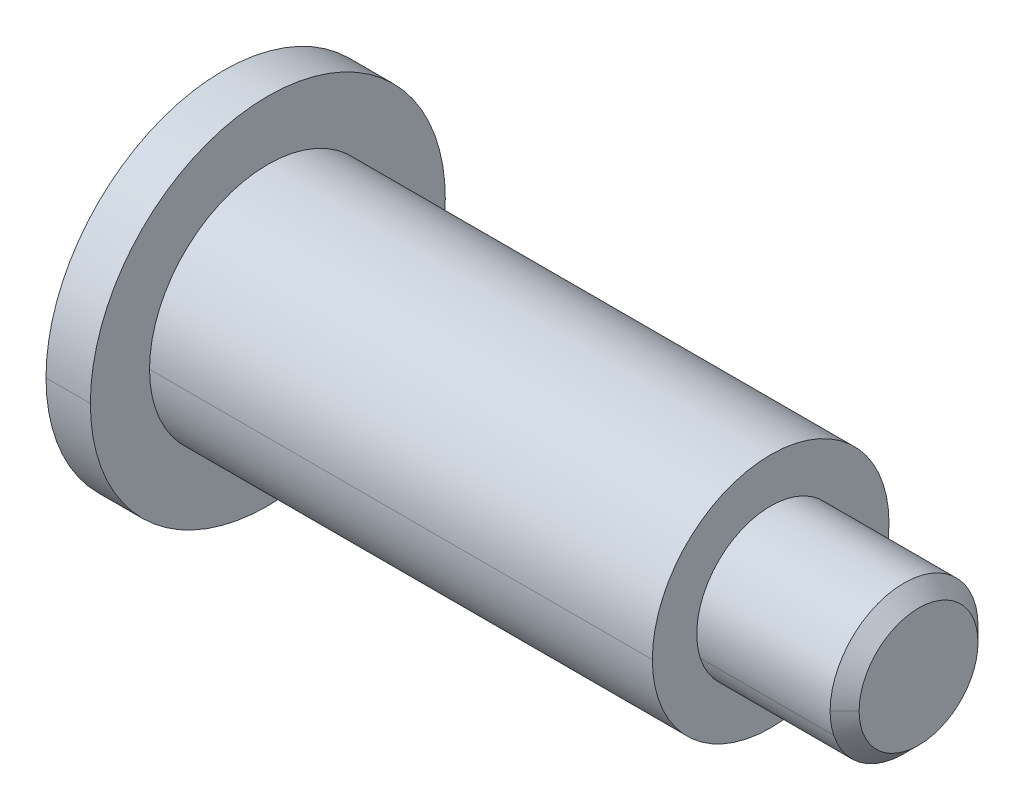
ISO-10303-21;
HEADER;
FILE_DESCRIPTION(('STEP AP214'),'2;1');
FILE_NAME('part.step','',(''),(''),'','','');
FILE_SCHEMA(('AUTOMOTIVE_DESIGN { 1 0 10303 214 1 1 1 1 }'));
ENDSEC;
DATA;
#1=APPLICATION_CONTEXT('core data for automotive mechanical design processes');
#2=APPLICATION_PROTOCOL_DEFINITION('international standard','automotive_design',2000,#1);
#3=PRODUCT_CONTEXT('',#1,'mechanical');
#4=PRODUCT('Part','Part','',(#3));
#5=PRODUCT_RELATED_PRODUCT_CATEGORY('part','',(#4));
#6=PRODUCT_DEFINITION_FORMATION('','',#4);
#7=PRODUCT_DEFINITION_CONTEXT('part definition',#1,'design');
#8=PRODUCT_DEFINITION('design','',#6,#7);
#9=PRODUCT_DEFINITION_SHAPE('','',#8);
#10=(LENGTH_UNIT() NAMED_UNIT(*) SI_UNIT(.MILLI.,.METRE.));
#11=(NAMED_UNIT(*) PLANE_ANGLE_UNIT() SI_UNIT($,.RADIAN.));
#12=(NAMED_UNIT(*) SI_UNIT($,.STERADIAN.) SOLID_ANGLE_UNIT());
#13=UNCERTAINTY_MEASURE_WITH_UNIT(LENGTH_MEASURE(1.E-05),#10,'distance_accuracy_value','');
#14=(GEOMETRIC_REPRESENTATION_CONTEXT(3) GLOBAL_UNCERTAINTY_ASSIGNED_CONTEXT((#13)) GLOBAL_UNIT_ASSIGNED_CONTEXT((#10,
#11,#12)) REPRESENTATION_CONTEXT('',''));
#15=CARTESIAN_POINT('',(0.,0.,0.));
#16=DIRECTION('',(0.,0.,1.));
#17=DIRECTION('',(1.,0.,0.));
#18=AXIS2_PLACEMENT_3D('',#15,#16,#17);
#19=CARTESIAN_POINT('',(-1.5,0.,0.));
#20=DIRECTION('',(1.,0.,0.));
#21=DIRECTION('',(0.,0.,-1.));
#22=AXIS2_PLACEMENT_3D('',#19,#20,#21);
#23=PLANE('',#22);
#24=CARTESIAN_POINT('',(-1.5,0.,0.));
#25=DIRECTION('',(1.,0.,0.));
#26=DIRECTION('',(0.,0.,-1.));
#27=AXIS2_PLACEMENT_3D('',#24,#25,#26);
#28=CIRCLE('',#27,6.);
#29=CARTESIAN_POINT('',(-1.5,0.,6.));
#30=VERTEX_POINT('',#29);
#31=CARTESIAN_POINT('',(-1.5,0.,-6.));
#32=VERTEX_POINT('',#31);
#33=EDGE_CURVE('E10',#30,#32,#28,.T.);
#34=ORIENTED_EDGE('',*,*,#33,.F.);
#35=CARTESIAN_POINT('',(-1.5,0.,0.));
#36=DIRECTION('',(1.,0.,0.));
#37=DIRECTION('',(0.,0.,-1.));
#38=AXIS2_PLACEMENT_3D('',#35,#36,#37);
#39=CIRCLE('',#38,6.);
#40=EDGE_CURVE('E23',#32,#30,#39,.T.);
#41=ORIENTED_EDGE('',*,*,#40,.F.);
#42=EDGE_LOOP('',(#34,#41));
#43=FACE_BOUND('',#42,.T.);
#44=DIRECTION('',(0.,0.500000000000009,-0.866025403784433));
#45=VECTOR('',#44,1.);
#46=CARTESIAN_POINT('',(-1.5,-1.7320508075689,0.));
#47=LINE('',#46,#45);
#48=CARTESIAN_POINT('',(-1.5,-1.7320508075689,0.));
#49=VERTEX_POINT('',#48);
#50=CARTESIAN_POINT('',(-1.5,-0.86602540378444,-1.5));
#51=VERTEX_POINT('',#50);
#52=EDGE_CURVE('E375',#49,#51,#47,.T.);
#53=ORIENTED_EDGE('',*,*,#52,.T.);
#54=DIRECTION('',(0.,1.,0.));
#55=VECTOR('',#54,1.);
#56=CARTESIAN_POINT('',(-1.5,-0.86602540378444,-1.5));
#57=LINE('',#56,#55);
#58=CARTESIAN_POINT('',(-1.5,0.86602540378444,-1.5));
#59=VERTEX_POINT('',#58);
#60=EDGE_CURVE('E371',#51,#59,#57,.T.);
#61=ORIENTED_EDGE('',*,*,#60,.T.);
#62=DIRECTION('',(0.,0.500000000000009,0.866025403784433));
#63=VECTOR('',#62,1.);
#64=CARTESIAN_POINT('',(-1.5,0.86602540378444,-1.5));
#65=LINE('',#64,#63);
#66=CARTESIAN_POINT('',(-1.5,1.7320508075689,0.));
#67=VERTEX_POINT('',#66);
#68=EDGE_CURVE('E367',#59,#67,#65,.T.);
#69=ORIENTED_EDGE('',*,*,#68,.T.);
#70=DIRECTION('',(0.,-0.500000000000009,0.866025403784433));
#71=VECTOR('',#70,1.);
#72=CARTESIAN_POINT('',(-1.5,1.7320508075689,0.));
#73=LINE('',#72,#71);
#74=CARTESIAN_POINT('',(-1.5,0.86602540378444,1.5));
#75=VERTEX_POINT('',#74);
#76=EDGE_CURVE('E363',#67,#75,#73,.T.);
#77=ORIENTED_EDGE('',*,*,#76,.T.);
#78=DIRECTION('',(0.,-1.,0.));
#79=VECTOR('',#78,1.);
#80=CARTESIAN_POINT('',(-1.5,0.86602540378444,1.5));
#81=LINE('',#80,#79);
#82=CARTESIAN_POINT('',(-1.5,-0.86602540378444,1.5));
#83=VERTEX_POINT('',#82);
#84=EDGE_CURVE('E359',#75,#83,#81,.T.);
#85=ORIENTED_EDGE('',*,*,#84,.T.);
#86=DIRECTION('',(0.,-0.500000000000009,-0.866025403784433));
#87=VECTOR('',#86,1.);
#88=CARTESIAN_POINT('',(-1.5,-0.86602540378444,1.5));
#89=LINE('',#88,#87);
#90=EDGE_CURVE('E355',#83,#49,#89,.T.);
#91=ORIENTED_EDGE('',*,*,#90,.T.);
#92=EDGE_LOOP('',(#53,#61,#69,#77,#85,#91));
#93=FACE_BOUND('',#92,.T.);
#94=ADVANCED_FACE('F15',(#43,#93),#23,.F.);
#95=CARTESIAN_POINT('',(1.5,-0.86602540378444,1.5));
#96=DIRECTION('',(0.,0.866025403784433,-0.500000000000009));
#97=DIRECTION('',(0.,0.500000000000009,0.866025403784433));
#98=AXIS2_PLACEMENT_3D('',#95,#96,#97);
#99=PLANE('',#98);
#100=ORIENTED_EDGE('',*,*,#90,.F.);
#101=DIRECTION('',(-1.,0.,0.));
#102=VECTOR('',#101,1.);
#103=CARTESIAN_POINT('',(1.5,-0.86602540378444,1.5));
#104=LINE('',#103,#102);
#105=CARTESIAN_POINT('',(1.5,-0.86602540378444,1.5));
#106=VERTEX_POINT('',#105);
#107=EDGE_CURVE('E350',#106,#83,#104,.T.);
#108=ORIENTED_EDGE('',*,*,#107,.F.);
#109=DIRECTION('',(0.,-0.500000000000009,-0.866025403784433));
#110=VECTOR('',#109,1.);
#111=CARTESIAN_POINT('',(1.5,-0.86602540378444,1.5));
#112=LINE('',#111,#110);
#113=CARTESIAN_POINT('',(1.5,-1.29903810567666,0.750000000000019));
#114=VERTEX_POINT('',#113);
#115=EDGE_CURVE('E346',#106,#114,#112,.T.);
#116=ORIENTED_EDGE('',*,*,#115,.T.);
#117=DIRECTION('',(0.,-0.500000000000009,-0.866025403784433));
#118=VECTOR('',#117,1.);
#119=CARTESIAN_POINT('',(1.5,-0.86602540378444,1.5));
#120=LINE('',#119,#118);
#121=CARTESIAN_POINT('',(1.5,-1.7320508075689,0.));
#122=VERTEX_POINT('',#121);
#123=EDGE_CURVE('E342',#114,#122,#120,.T.);
#124=ORIENTED_EDGE('',*,*,#123,.T.);
#125=DIRECTION('',(-1.,0.,0.));
#126=VECTOR('',#125,1.);
#127=CARTESIAN_POINT('',(1.5,-1.7320508075689,0.));
#128=LINE('',#127,#126);
#129=EDGE_CURVE('E337',#122,#49,#128,.T.);
#130=ORIENTED_EDGE('',*,*,#129,.T.);
#131=EDGE_LOOP('',(#100,#108,#116,#124,#130));
#132=FACE_BOUND('',#131,.T.);
#133=ADVANCED_FACE('F404',(#132),#99,.T.);
#134=CARTESIAN_POINT('',(1.5,-1.7320508075689,0.));
#135=DIRECTION('',(0.,0.866025403784433,0.500000000000009));
#136=DIRECTION('',(0.,-0.500000000000009,0.866025403784433));
#137=AXIS2_PLACEMENT_3D('',#134,#135,#136);
#138=PLANE('',#137);
#139=ORIENTED_EDGE('',*,*,#52,.F.);
#140=ORIENTED_EDGE('',*,*,#129,.F.);
#141=DIRECTION('',(0.,0.500000000000009,-0.866025403784433));
#142=VECTOR('',#141,1.);
#143=CARTESIAN_POINT('',(1.5,-1.7320508075689,0.));
#144=LINE('',#143,#142);
#145=CARTESIAN_POINT('',(1.5,-1.29903810567665,-0.750000000000014));
#146=VERTEX_POINT('',#145);
#147=EDGE_CURVE('E333',#122,#146,#144,.T.);
#148=ORIENTED_EDGE('',*,*,#147,.T.);
#149=DIRECTION('',(0.,0.500000000000009,-0.866025403784433));
#150=VECTOR('',#149,1.);
#151=CARTESIAN_POINT('',(1.5,-1.7320508075689,0.));
#152=LINE('',#151,#150);
#153=CARTESIAN_POINT('',(1.5,-0.86602540378444,-1.5));
#154=VERTEX_POINT('',#153);
#155=EDGE_CURVE('E329',#146,#154,#152,.T.);
#156=ORIENTED_EDGE('',*,*,#155,.T.);
#157=DIRECTION('',(-1.,0.,0.));
#158=VECTOR('',#157,1.);
#159=CARTESIAN_POINT('',(1.5,-0.86602540378444,-1.5));
#160=LINE('',#159,#158);
#161=EDGE_CURVE('E324',#154,#51,#160,.T.);
#162=ORIENTED_EDGE('',*,*,#161,.T.);
#163=EDGE_LOOP('',(#139,#140,#148,#156,#162));
#164=FACE_BOUND('',#163,.T.);
#165=ADVANCED_FACE('F408',(#164),#138,.T.);
#166=CARTESIAN_POINT('',(1.5,-0.86602540378444,-1.5));
#167=DIRECTION('',(0.,0.,1.));
#168=DIRECTION('',(1.,0.,0.));
#169=AXIS2_PLACEMENT_3D('',#166,#167,#168);
#170=PLANE('',#169);
#171=ORIENTED_EDGE('',*,*,#60,.F.);
#172=ORIENTED_EDGE('',*,*,#161,.F.);
#173=DIRECTION('',(0.,1.,0.));
#174=VECTOR('',#173,1.);
#175=CARTESIAN_POINT('',(1.5,-0.86602540378444,-1.5));
#176=LINE('',#175,#174);
#177=CARTESIAN_POINT('',(1.5,0.,-1.5));
#178=VERTEX_POINT('',#177);
#179=EDGE_CURVE('E320',#154,#178,#176,.T.);
#180=ORIENTED_EDGE('',*,*,#179,.T.);
#181=DIRECTION('',(0.,1.,0.));
#182=VECTOR('',#181,1.);
#183=CARTESIAN_POINT('',(1.5,-0.86602540378444,-1.5));
#184=LINE('',#183,#182);
#185=CARTESIAN_POINT('',(1.5,0.86602540378444,-1.5));
#186=VERTEX_POINT('',#185);
#187=EDGE_CURVE('E316',#178,#186,#184,.T.);
#188=ORIENTED_EDGE('',*,*,#187,.T.);
#189=DIRECTION('',(-1.,0.,0.));
#190=VECTOR('',#189,1.);
#191=CARTESIAN_POINT('',(1.5,0.86602540378444,-1.5));
#192=LINE('',#191,#190);
#193=EDGE_CURVE('E311',#186,#59,#192,.T.);
#194=ORIENTED_EDGE('',*,*,#193,.T.);
#195=EDGE_LOOP('',(#171,#172,#180,#188,#194));
#196=FACE_BOUND('',#195,.T.);
#197=ADVANCED_FACE('F420',(#196),#170,.T.);
#198=CARTESIAN_POINT('',(1.5,0.86602540378444,-1.5));
#199=DIRECTION('',(0.,-0.866025403784433,0.500000000000009));
#200=DIRECTION('',(0.,-0.500000000000009,-0.866025403784433));
#201=AXIS2_PLACEMENT_3D('',#198,#199,#200);
#202=PLANE('',#201);
#203=ORIENTED_EDGE('',*,*,#68,.F.);
#204=ORIENTED_EDGE('',*,*,#193,.F.);
#205=DIRECTION('',(0.,0.500000000000009,0.866025403784433));
#206=VECTOR('',#205,1.);
#207=CARTESIAN_POINT('',(1.5,0.86602540378444,-1.5));
#208=LINE('',#207,#206);
#209=CARTESIAN_POINT('',(1.5,1.29903810567666,-0.750000000000019));
#210=VERTEX_POINT('',#209);
#211=EDGE_CURVE('E307',#186,#210,#208,.T.);
#212=ORIENTED_EDGE('',*,*,#211,.T.);
#213=DIRECTION('',(0.,0.500000000000009,0.866025403784433));
#214=VECTOR('',#213,1.);
#215=CARTESIAN_POINT('',(1.5,0.86602540378444,-1.5));
#216=LINE('',#215,#214);
#217=CARTESIAN_POINT('',(1.5,1.7320508075689,0.));
#218=VERTEX_POINT('',#217);
#219=EDGE_CURVE('E303',#210,#218,#216,.T.);
#220=ORIENTED_EDGE('',*,*,#219,.T.);
#221=DIRECTION('',(-1.,0.,0.));
#222=VECTOR('',#221,1.);
#223=CARTESIAN_POINT('',(1.5,1.7320508075689,0.));
#224=LINE('',#223,#222);
#225=EDGE_CURVE('E298',#218,#67,#224,.T.);
#226=ORIENTED_EDGE('',*,*,#225,.T.);
#227=EDGE_LOOP('',(#203,#204,#212,#220,#226));
#228=FACE_BOUND('',#227,.T.);
#229=ADVANCED_FACE('F426',(#228),#202,.T.);
#230=CARTESIAN_POINT('',(1.5,1.7320508075689,0.));
#231=DIRECTION('',(0.,-0.866025403784433,-0.500000000000009));
#232=DIRECTION('',(0.,0.500000000000009,-0.866025403784433));
#233=AXIS2_PLACEMENT_3D('',#230,#231,#232);
#234=PLANE('',#233);
#235=ORIENTED_EDGE('',*,*,#76,.F.);
#236=ORIENTED_EDGE('',*,*,#225,.F.);
#237=DIRECTION('',(0.,-0.500000000000009,0.866025403784433));
#238=VECTOR('',#237,1.);
#239=CARTESIAN_POINT('',(1.5,1.7320508075689,0.));
#240=LINE('',#239,#238);
#241=CARTESIAN_POINT('',(1.5,1.29903810567666,0.750000000000019));
#242=VERTEX_POINT('',#241);
#243=EDGE_CURVE('E294',#218,#242,#240,.T.);
#244=ORIENTED_EDGE('',*,*,#243,.T.);
#245=DIRECTION('',(0.,-0.500000000000009,0.866025403784433));
#246=VECTOR('',#245,1.);
#247=CARTESIAN_POINT('',(1.5,1.7320508075689,0.));
#248=LINE('',#247,#246);
#249=CARTESIAN_POINT('',(1.5,0.86602540378444,1.5));
#250=VERTEX_POINT('',#249);
#251=EDGE_CURVE('E290',#242,#250,#248,.T.);
#252=ORIENTED_EDGE('',*,*,#251,.T.);
#253=DIRECTION('',(-1.,0.,0.));
#254=VECTOR('',#253,1.);
#255=CARTESIAN_POINT('',(1.5,0.86602540378444,1.5));
#256=LINE('',#255,#254);
#257=EDGE_CURVE('E285',#250,#75,#256,.T.);
#258=ORIENTED_EDGE('',*,*,#257,.T.);
#259=EDGE_LOOP('',(#235,#236,#244,#252,#258));
#260=FACE_BOUND('',#259,.T.);
#261=ADVANCED_FACE('F432',(#260),#234,.T.);
#262=CARTESIAN_POINT('',(1.5,0.86602540378444,1.5));
#263=DIRECTION('',(0.,0.,-1.));
#264=DIRECTION('',(-1.,0.,0.));
#265=AXIS2_PLACEMENT_3D('',#262,#263,#264);
#266=PLANE('',#265);
#267=ORIENTED_EDGE('',*,*,#84,.F.);
#268=ORIENTED_EDGE('',*,*,#257,.F.);
#269=DIRECTION('',(0.,-1.,0.));
#270=VECTOR('',#269,1.);
#271=CARTESIAN_POINT('',(1.5,0.86602540378444,1.5));
#272=LINE('',#271,#270);
#273=CARTESIAN_POINT('',(1.5,0.,1.5));
#274=VERTEX_POINT('',#273);
#275=EDGE_CURVE('E281',#250,#274,#272,.T.);
#276=ORIENTED_EDGE('',*,*,#275,.T.);
#277=DIRECTION('',(0.,-1.,0.));
#278=VECTOR('',#277,1.);
#279=CARTESIAN_POINT('',(1.5,0.86602540378444,1.5));
#280=LINE('',#279,#278);
#281=EDGE_CURVE('E276',#274,#106,#280,.T.);
#282=ORIENTED_EDGE('',*,*,#281,.T.);
#283=ORIENTED_EDGE('',*,*,#107,.T.);
#284=EDGE_LOOP('',(#267,#268,#276,#282,#283));
#285=FACE_BOUND('',#284,.T.);
#286=ADVANCED_FACE('F436',(#285),#266,.T.);
#287=CARTESIAN_POINT('',(1.5,0.,0.));
#288=DIRECTION('',(1.,0.,0.));
#289=DIRECTION('',(0.,0.,-1.));
#290=AXIS2_PLACEMENT_3D('',#287,#288,#289);
#291=PLANE('',#290);
#292=CARTESIAN_POINT('',(1.5,0.,0.));
#293=DIRECTION('',(1.,0.,0.));
#294=DIRECTION('',(0.,0.,-1.));
#295=AXIS2_PLACEMENT_3D('',#292,#293,#294);
#296=CIRCLE('',#295,1.5);
#297=EDGE_CURVE('E271',#274,#114,#296,.T.);
#298=ORIENTED_EDGE('',*,*,#297,.T.);
#299=ORIENTED_EDGE('',*,*,#115,.F.);
#300=ORIENTED_EDGE('',*,*,#281,.F.);
#301=EDGE_LOOP('',(#298,#299,#300));
#302=FACE_BOUND('',#301,.T.);
#303=ADVANCED_FACE('F477',(#302),#291,.F.);
#304=CARTESIAN_POINT('',(1.5,0.,0.));
#305=DIRECTION('',(-1.,0.,0.));
#306=DIRECTION('',(0.,1.,0.));
#307=AXIS2_PLACEMENT_3D('',#304,#305,#306);
#308=CONICAL_SURFACE('',#307,1.5,1.04719755119662);
#309=DIRECTION('',(-0.499999999999983,0.,-0.866025403784448));
#310=VECTOR('',#309,1.);
#311=CARTESIAN_POINT('',(2.3660254037844,0.,0.));
#312=LINE('',#311,#310);
#313=CARTESIAN_POINT('',(2.3660254037844,0.,0.));
#314=VERTEX_POINT('',#313);
#315=EDGE_CURVE('E266',#314,#178,#312,.T.);
#316=ORIENTED_EDGE('',*,*,#315,.T.);
#317=CARTESIAN_POINT('',(1.5,0.,0.));
#318=DIRECTION('',(1.,0.,0.));
#319=DIRECTION('',(0.,0.,-1.));
#320=AXIS2_PLACEMENT_3D('',#317,#318,#319);
#321=CIRCLE('',#320,1.5);
#322=EDGE_CURVE('E261',#146,#178,#321,.T.);
#323=ORIENTED_EDGE('',*,*,#322,.F.);
#324=CARTESIAN_POINT('',(1.5,0.,0.));
#325=DIRECTION('',(1.,0.,0.));
#326=DIRECTION('',(0.,0.,-1.));
#327=AXIS2_PLACEMENT_3D('',#324,#325,#326);
#328=CIRCLE('',#327,1.5);
#329=EDGE_CURVE('E256',#114,#146,#328,.T.);
#330=ORIENTED_EDGE('',*,*,#329,.F.);
#331=ORIENTED_EDGE('',*,*,#297,.F.);
#332=DIRECTION('',(-0.499999999999983,0.,0.866025403784448));
#333=VECTOR('',#332,1.);
#334=CARTESIAN_POINT('',(2.3660254037844,0.,0.));
#335=LINE('',#334,#333);
#336=EDGE_CURVE('E251',#314,#274,#335,.T.);
#337=ORIENTED_EDGE('',*,*,#336,.F.);
#338=EDGE_LOOP('',(#316,#323,#330,#331,#337));
#339=FACE_BOUND('',#338,.T.);
#340=ADVANCED_FACE('F445',(#339),#308,.F.);
#341=CARTESIAN_POINT('',(1.5,0.,0.));
#342=DIRECTION('',(-1.,0.,0.));
#343=DIRECTION('',(0.,-1.,0.));
#344=AXIS2_PLACEMENT_3D('',#341,#342,#343);
#345=CONICAL_SURFACE('',#344,1.5,1.04719755119662);
#346=ORIENTED_EDGE('',*,*,#336,.T.);
#347=CARTESIAN_POINT('',(1.5,0.,0.));
#348=DIRECTION('',(1.,0.,0.));
#349=DIRECTION('',(0.,0.,-1.));
#350=AXIS2_PLACEMENT_3D('',#347,#348,#349);
#351=CIRCLE('',#350,1.5);
#352=EDGE_CURVE('E246',#242,#274,#351,.T.);
#353=ORIENTED_EDGE('',*,*,#352,.F.);
#354=CARTESIAN_POINT('',(1.5,0.,0.));
#355=DIRECTION('',(1.,0.,0.));
#356=DIRECTION('',(0.,0.,-1.));
#357=AXIS2_PLACEMENT_3D('',#354,#355,#356);
#358=CIRCLE('',#357,1.5);
#359=EDGE_CURVE('E241',#210,#242,#358,.T.);
#360=ORIENTED_EDGE('',*,*,#359,.F.);
#361=CARTESIAN_POINT('',(1.5,0.,0.));
#362=DIRECTION('',(1.,0.,0.));
#363=DIRECTION('',(0.,0.,-1.));
#364=AXIS2_PLACEMENT_3D('',#361,#362,#363);
#365=CIRCLE('',#364,1.5);
#366=EDGE_CURVE('E236',#178,#210,#365,.T.);
#367=ORIENTED_EDGE('',*,*,#366,.F.);
#368=ORIENTED_EDGE('',*,*,#315,.F.);
#369=EDGE_LOOP('',(#346,#353,#360,#367,#368));
#370=FACE_BOUND('',#369,.T.);
#371=ADVANCED_FACE('F470',(#370),#345,.F.);
#372=CARTESIAN_POINT('',(1.5,0.,0.));
#373=DIRECTION('',(1.,0.,0.));
#374=DIRECTION('',(0.,0.,-1.));
#375=AXIS2_PLACEMENT_3D('',#372,#373,#374);
#376=PLANE('',#375);
#377=ORIENTED_EDGE('',*,*,#366,.T.);
#378=ORIENTED_EDGE('',*,*,#211,.F.);
#379=ORIENTED_EDGE('',*,*,#187,.F.);
#380=EDGE_LOOP('',(#377,#378,#379));
#381=FACE_BOUND('',#380,.T.);
#382=ADVANCED_FACE('F466',(#381),#376,.F.);
#383=CARTESIAN_POINT('',(1.5,0.,0.));
#384=DIRECTION('',(1.,0.,0.));
#385=DIRECTION('',(0.,0.,-1.));
#386=AXIS2_PLACEMENT_3D('',#383,#384,#385);
#387=PLANE('',#386);
#388=ORIENTED_EDGE('',*,*,#219,.F.);
#389=ORIENTED_EDGE('',*,*,#359,.T.);
#390=ORIENTED_EDGE('',*,*,#243,.F.);
#391=EDGE_LOOP('',(#388,#389,#390));
#392=FACE_BOUND('',#391,.T.);
#393=ADVANCED_FACE('F459',(#392),#387,.F.);
#394=CARTESIAN_POINT('',(1.5,0.,0.));
#395=DIRECTION('',(1.,0.,0.));
#396=DIRECTION('',(0.,0.,-1.));
#397=AXIS2_PLACEMENT_3D('',#394,#395,#396);
#398=PLANE('',#397);
#399=ORIENTED_EDGE('',*,*,#352,.T.);
#400=ORIENTED_EDGE('',*,*,#275,.F.);
#401=ORIENTED_EDGE('',*,*,#251,.F.);
#402=EDGE_LOOP('',(#399,#400,#401));
#403=FACE_BOUND('',#402,.T.);
#404=ADVANCED_FACE('F452',(#403),#398,.F.);
#405=CARTESIAN_POINT('',(1.5,0.,0.));
#406=DIRECTION('',(1.,0.,0.));
#407=DIRECTION('',(0.,0.,-1.));
#408=AXIS2_PLACEMENT_3D('',#405,#406,#407);
#409=PLANE('',#408);
#410=ORIENTED_EDGE('',*,*,#329,.T.);
#411=ORIENTED_EDGE('',*,*,#147,.F.);
#412=ORIENTED_EDGE('',*,*,#123,.F.);
#413=EDGE_LOOP('',(#410,#411,#412));
#414=FACE_BOUND('',#413,.T.);
#415=ADVANCED_FACE('F450',(#414),#409,.F.);
#416=CARTESIAN_POINT('',(1.5,0.,0.));
#417=DIRECTION('',(1.,0.,0.));
#418=DIRECTION('',(0.,0.,-1.));
#419=AXIS2_PLACEMENT_3D('',#416,#417,#418);
#420=PLANE('',#419);
#421=ORIENTED_EDGE('',*,*,#322,.T.);
#422=ORIENTED_EDGE('',*,*,#179,.F.);
#423=ORIENTED_EDGE('',*,*,#155,.F.);
#424=EDGE_LOOP('',(#421,#422,#423));
#425=FACE_BOUND('',#424,.T.);
#426=ADVANCED_FACE('F449',(#425),#420,.F.);
#427=CARTESIAN_POINT('',(17.,0.,0.));
#428=DIRECTION('',(1.,0.,0.));
#429=DIRECTION('',(0.,-1.,0.));
#430=AXIS2_PLACEMENT_3D('',#427,#428,#429);
#431=CYLINDRICAL_SURFACE('',#430,6.);
#432=DIRECTION('',(1.,0.,0.));
#433=VECTOR('',#432,1.);
#434=CARTESIAN_POINT('',(-1.5,0.,6.));
#435=LINE('',#434,#433);
#436=CARTESIAN_POINT('',(0.,0.,6.));
#437=VERTEX_POINT('',#436);
#438=EDGE_CURVE('E232',#30,#437,#435,.T.);
#439=ORIENTED_EDGE('',*,*,#438,.T.);
#440=CARTESIAN_POINT('',(0.,0.,0.));
#441=DIRECTION('',(1.,0.,0.));
#442=DIRECTION('',(0.,0.,-1.));
#443=AXIS2_PLACEMENT_3D('',#440,#441,#442);
#444=CIRCLE('',#443,6.);
#445=CARTESIAN_POINT('',(0.,0.,-6.));
#446=VERTEX_POINT('',#445);
#447=EDGE_CURVE('E227',#446,#437,#444,.T.);
#448=ORIENTED_EDGE('',*,*,#447,.F.);
#449=DIRECTION('',(1.,0.,0.));
#450=VECTOR('',#449,1.);
#451=CARTESIAN_POINT('',(-1.5,0.,-6.));
#452=LINE('',#451,#450);
#453=EDGE_CURVE('E222',#32,#446,#452,.T.);
#454=ORIENTED_EDGE('',*,*,#453,.F.);
#455=ORIENTED_EDGE('',*,*,#40,.T.);
#456=EDGE_LOOP('',(#439,#448,#454,#455));
#457=FACE_BOUND('',#456,.T.);
#458=ADVANCED_FACE('F384',(#457),#431,.T.);
#459=CARTESIAN_POINT('',(17.,0.,0.));
#460=DIRECTION('',(1.,0.,0.));
#461=DIRECTION('',(0.,1.,0.));
#462=AXIS2_PLACEMENT_3D('',#459,#460,#461);
#463=CYLINDRICAL_SURFACE('',#462,6.);
#464=ORIENTED_EDGE('',*,*,#438,.F.);
#465=ORIENTED_EDGE('',*,*,#33,.T.);
#466=ORIENTED_EDGE('',*,*,#453,.T.);
#467=CARTESIAN_POINT('',(0.,0.,0.));
#468=DIRECTION('',(1.,0.,0.));
#469=DIRECTION('',(0.,0.,-1.));
#470=AXIS2_PLACEMENT_3D('',#467,#468,#469);
#471=CIRCLE('',#470,6.);
#472=EDGE_CURVE('E217',#437,#446,#471,.T.);
#473=ORIENTED_EDGE('',*,*,#472,.F.);
#474=EDGE_LOOP('',(#464,#465,#466,#473));
#475=FACE_BOUND('',#474,.T.);
#476=ADVANCED_FACE('F387',(#475),#463,.T.);
#477=CARTESIAN_POINT('',(0.,6.,0.));
#478=DIRECTION('',(-1.,0.,0.));
#479=DIRECTION('',(0.,0.,1.));
#480=AXIS2_PLACEMENT_3D('',#477,#478,#479);
#481=PLANE('',#480);
#482=CARTESIAN_POINT('',(0.,0.,0.));
#483=DIRECTION('',(1.,0.,0.));
#484=DIRECTION('',(0.,0.,-1.));
#485=AXIS2_PLACEMENT_3D('',#482,#483,#484);
#486=CIRCLE('',#485,4.);
#487=CARTESIAN_POINT('',(0.,0.,4.));
#488=VERTEX_POINT('',#487);
#489=CARTESIAN_POINT('',(0.,0.,-4.));
#490=VERTEX_POINT('',#489);
#491=EDGE_CURVE('E212',#488,#490,#486,.T.);
#492=ORIENTED_EDGE('',*,*,#491,.F.);
#493=CARTESIAN_POINT('',(0.,0.,0.));
#494=DIRECTION('',(1.,0.,0.));
#495=DIRECTION('',(0.,0.,-1.));
#496=AXIS2_PLACEMENT_3D('',#493,#494,#495);
#497=CIRCLE('',#496,4.);
#498=EDGE_CURVE('E207',#490,#488,#497,.T.);
#499=ORIENTED_EDGE('',*,*,#498,.F.);
#500=EDGE_LOOP('',(#492,#499));
#501=FACE_BOUND('',#500,.T.);
#502=ORIENTED_EDGE('',*,*,#447,.T.);
#503=ORIENTED_EDGE('',*,*,#472,.T.);
#504=EDGE_LOOP('',(#502,#503));
#505=FACE_BOUND('',#504,.T.);
#506=ADVANCED_FACE('F389',(#501,#505),#481,.F.);
#507=CARTESIAN_POINT('',(17.,0.,0.));
#508=DIRECTION('',(1.,0.,0.));
#509=DIRECTION('',(0.,-1.,0.));
#510=AXIS2_PLACEMENT_3D('',#507,#508,#509);
#511=CYLINDRICAL_SURFACE('',#510,4.);
#512=DIRECTION('',(1.,0.,0.));
#513=VECTOR('',#512,1.);
#514=CARTESIAN_POINT('',(0.,0.,4.));
#515=LINE('',#514,#513);
#516=CARTESIAN_POINT('',(17.,0.,4.));
#517=VERTEX_POINT('',#516);
#518=EDGE_CURVE('E203',#488,#517,#515,.T.);
#519=ORIENTED_EDGE('',*,*,#518,.T.);
#520=CARTESIAN_POINT('',(17.,0.,0.));
#521=DIRECTION('',(1.,0.,0.));
#522=DIRECTION('',(0.,0.,-1.));
#523=AXIS2_PLACEMENT_3D('',#520,#521,#522);
#524=CIRCLE('',#523,4.);
#525=CARTESIAN_POINT('',(17.,0.,-4.));
#526=VERTEX_POINT('',#525);
#527=EDGE_CURVE('E198',#526,#517,#524,.T.);
#528=ORIENTED_EDGE('',*,*,#527,.F.);
#529=DIRECTION('',(1.,0.,0.));
#530=VECTOR('',#529,1.);
#531=CARTESIAN_POINT('',(0.,0.,-4.));
#532=LINE('',#531,#530);
#533=EDGE_CURVE('E193',#490,#526,#532,.T.);
#534=ORIENTED_EDGE('',*,*,#533,.F.);
#535=ORIENTED_EDGE('',*,*,#498,.T.);
#536=EDGE_LOOP('',(#519,#528,#534,#535));
#537=FACE_BOUND('',#536,.T.);
#538=ADVANCED_FACE('F391',(#537),#511,.T.);
#539=CARTESIAN_POINT('',(17.,0.,0.));
#540=DIRECTION('',(1.,0.,0.));
#541=DIRECTION('',(0.,1.,0.));
#542=AXIS2_PLACEMENT_3D('',#539,#540,#541);
#543=CYLINDRICAL_SURFACE('',#542,4.);
#544=ORIENTED_EDGE('',*,*,#518,.F.);
#545=ORIENTED_EDGE('',*,*,#491,.T.);
#546=ORIENTED_EDGE('',*,*,#533,.T.);
#547=CARTESIAN_POINT('',(17.,0.,0.));
#548=DIRECTION('',(1.,0.,0.));
#549=DIRECTION('',(0.,0.,-1.));
#550=AXIS2_PLACEMENT_3D('',#547,#548,#549);
#551=CIRCLE('',#550,4.);
#552=EDGE_CURVE('E188',#517,#526,#551,.T.);
#553=ORIENTED_EDGE('',*,*,#552,.F.);
#554=EDGE_LOOP('',(#544,#545,#546,#553));
#555=FACE_BOUND('',#554,.T.);
#556=ADVANCED_FACE('F399',(#555),#543,.T.);
#557=CARTESIAN_POINT('',(17.,4.,0.));
#558=DIRECTION('',(-1.,0.,0.));
#559=DIRECTION('',(0.,0.,1.));
#560=AXIS2_PLACEMENT_3D('',#557,#558,#559);
#561=PLANE('',#560);
#562=CARTESIAN_POINT('',(17.,0.,0.));
#563=DIRECTION('',(1.,0.,0.));
#564=DIRECTION('',(0.,0.,-1.));
#565=AXIS2_PLACEMENT_3D('',#562,#563,#564);
#566=CIRCLE('',#565,2.5);
#567=CARTESIAN_POINT('',(17.,-0.772542485937367,2.37764129073788));
#568=VERTEX_POINT('',#567);
#569=CARTESIAN_POINT('',(17.,0.,-2.5));
#570=VERTEX_POINT('',#569);
#571=EDGE_CURVE('E183',#568,#570,#566,.T.);
#572=ORIENTED_EDGE('',*,*,#571,.F.);
#573=CARTESIAN_POINT('',(17.,0.,0.));
#574=DIRECTION('',(1.,0.,0.));
#575=DIRECTION('',(0.,0.,-1.));
#576=AXIS2_PLACEMENT_3D('',#573,#574,#575);
#577=CIRCLE('',#576,2.5);
#578=EDGE_CURVE('E178',#570,#568,#577,.T.);
#579=ORIENTED_EDGE('',*,*,#578,.F.);
#580=EDGE_LOOP('',(#572,#579));
#581=FACE_BOUND('',#580,.T.);
#582=ORIENTED_EDGE('',*,*,#527,.T.);
#583=ORIENTED_EDGE('',*,*,#552,.T.);
#584=EDGE_LOOP('',(#582,#583));
#585=FACE_BOUND('',#584,.T.);
#586=ADVANCED_FACE('F581',(#581,#585),#561,.F.);
#587=CARTESIAN_POINT('',(22.,0.,0.));
#588=DIRECTION('',(1.,0.,0.));
#589=DIRECTION('',(0.,-0.987688340595138,-0.156434465040231));
#590=AXIS2_PLACEMENT_3D('',#587,#588,#589);
#591=CYLINDRICAL_SURFACE('',#590,2.5);
#592=DIRECTION('',(1.,0.,0.));
#593=VECTOR('',#592,1.);
#594=CARTESIAN_POINT('',(17.,-0.772542485937367,2.37764129073788));
#595=LINE('',#594,#593);
#596=CARTESIAN_POINT('',(21.5095,-0.772542485937367,2.37764129073788));
#597=VERTEX_POINT('',#596);
#598=EDGE_CURVE('E174',#568,#597,#595,.T.);
#599=ORIENTED_EDGE('',*,*,#598,.T.);
#600=CARTESIAN_POINT('',(21.5095,0.,0.));
#601=DIRECTION('',(1.,0.,0.));
#602=DIRECTION('',(0.,0.,-1.));
#603=AXIS2_PLACEMENT_3D('',#600,#601,#602);
#604=CIRCLE('',#603,2.5);
#605=CARTESIAN_POINT('',(21.5095,0.,2.5));
#606=VERTEX_POINT('',#605);
#607=EDGE_CURVE('E170',#606,#597,#604,.T.);
#608=ORIENTED_EDGE('',*,*,#607,.F.);
#609=CARTESIAN_POINT('',(21.5095,0.,0.));
#610=DIRECTION('',(1.,0.,0.));
#611=DIRECTION('',(0.,0.,-1.));
#612=AXIS2_PLACEMENT_3D('',#609,#610,#611);
#613=CIRCLE('',#612,2.5);
#614=CARTESIAN_POINT('',(21.5095,0.,-2.5));
#615=VERTEX_POINT('',#614);
#616=EDGE_CURVE('E148',#615,#606,#613,.T.);
#617=ORIENTED_EDGE('',*,*,#616,.F.);
#618=DIRECTION('',(1.,0.,0.));
#619=VECTOR('',#618,1.);
#620=CARTESIAN_POINT('',(17.,0.,-2.5));
#621=LINE('',#620,#619);
#622=EDGE_CURVE('E162',#570,#615,#621,.T.);
#623=ORIENTED_EDGE('',*,*,#622,.F.);
#624=ORIENTED_EDGE('',*,*,#578,.T.);
#625=EDGE_LOOP('',(#599,#608,#617,#623,#624));
#626=FACE_BOUND('',#625,.T.);
#627=ADVANCED_FACE('F591',(#626),#591,.T.);
#628=CARTESIAN_POINT('',(22.,0.,0.));
#629=DIRECTION('',(1.,0.,0.));
#630=DIRECTION('',(0.,0.987688340595138,0.156434465040231));
#631=AXIS2_PLACEMENT_3D('',#628,#629,#630);
#632=CYLINDRICAL_SURFACE('',#631,2.5);
#633=ORIENTED_EDGE('',*,*,#598,.F.);
#634=ORIENTED_EDGE('',*,*,#571,.T.);
#635=ORIENTED_EDGE('',*,*,#622,.T.);
#636=CARTESIAN_POINT('',(21.5095,0.,0.));
#637=DIRECTION('',(1.,0.,0.));
#638=DIRECTION('',(0.,0.,-1.));
#639=AXIS2_PLACEMENT_3D('',#636,#637,#638);
#640=CIRCLE('',#639,2.5);
#641=EDGE_CURVE('E158',#597,#615,#640,.T.);
#642=ORIENTED_EDGE('',*,*,#641,.F.);
#643=EDGE_LOOP('',(#633,#634,#635,#642));
#644=FACE_BOUND('',#643,.T.);
#645=ADVANCED_FACE('F601',(#644),#632,.T.);
#646=CARTESIAN_POINT('',(21.5095,0.,0.));
#647=DIRECTION('',(-1.,0.,0.));
#648=DIRECTION('',(0.,1.,0.));
#649=AXIS2_PLACEMENT_3D('',#646,#647,#648);
#650=CONICAL_SURFACE('',#649,2.5,0.78539816339745);
#651=DIRECTION('',(-0.707106781186548,0.,-0.707106781186548));
#652=VECTOR('',#651,1.);
#653=CARTESIAN_POINT('',(22.,0.,-2.0095));
#654=LINE('',#653,#652);
#655=CARTESIAN_POINT('',(22.,0.,-2.0095));
#656=VERTEX_POINT('',#655);
#657=EDGE_CURVE('E139',#656,#615,#654,.T.);
#658=ORIENTED_EDGE('',*,*,#657,.F.);
#659=CARTESIAN_POINT('',(22.,0.,0.));
#660=DIRECTION('',(1.,0.,0.));
#661=DIRECTION('',(0.,0.,-1.));
#662=AXIS2_PLACEMENT_3D('',#659,#660,#661);
#663=CIRCLE('',#662,2.0095);
#664=CARTESIAN_POINT('',(22.,0.,2.0095));
#665=VERTEX_POINT('',#664);
#666=EDGE_CURVE('E130',#665,#656,#663,.T.);
#667=ORIENTED_EDGE('',*,*,#666,.F.);
#668=DIRECTION('',(-0.707106781186545,0.,0.70710678118655));
#669=VECTOR('',#668,1.);
#670=CARTESIAN_POINT('',(22.,0.,2.0095));
#671=LINE('',#670,#669);
#672=EDGE_CURVE('E135',#665,#606,#671,.T.);
#673=ORIENTED_EDGE('',*,*,#672,.T.);
#674=ORIENTED_EDGE('',*,*,#607,.T.);
#675=ORIENTED_EDGE('',*,*,#641,.T.);
#676=EDGE_LOOP('',(#658,#667,#673,#674,#675));
#677=FACE_BOUND('',#676,.T.);
#678=ADVANCED_FACE('F132',(#677),#650,.T.);
#679=CARTESIAN_POINT('',(21.5095,0.,0.));
#680=DIRECTION('',(-1.,0.,0.));
#681=DIRECTION('',(0.,-1.,0.));
#682=AXIS2_PLACEMENT_3D('',#679,#680,#681);
#683=CONICAL_SURFACE('',#682,2.5,0.78539816339745);
#684=ORIENTED_EDGE('',*,*,#657,.T.);
#685=ORIENTED_EDGE('',*,*,#616,.T.);
#686=ORIENTED_EDGE('',*,*,#672,.F.);
#687=CARTESIAN_POINT('',(22.,0.,0.));
#688=DIRECTION('',(1.,0.,0.));
#689=DIRECTION('',(0.,0.,-1.));
#690=AXIS2_PLACEMENT_3D('',#687,#688,#689);
#691=CIRCLE('',#690,2.0095);
#692=EDGE_CURVE('E143',#656,#665,#691,.T.);
#693=ORIENTED_EDGE('',*,*,#692,.F.);
#694=EDGE_LOOP('',(#684,#685,#686,#693));
#695=FACE_BOUND('',#694,.T.);
#696=ADVANCED_FACE('F147',(#695),#683,.T.);
#697=CARTESIAN_POINT('',(22.,2.0095,0.));
#698=DIRECTION('',(-1.,0.,0.));
#699=DIRECTION('',(0.,0.,1.));
#700=AXIS2_PLACEMENT_3D('',#697,#698,#699);
#701=PLANE('',#700);
#702=ORIENTED_EDGE('',*,*,#692,.T.);
#703=ORIENTED_EDGE('',*,*,#666,.T.);
#704=EDGE_LOOP('',(#702,#703));
#705=FACE_BOUND('',#704,.T.);
#706=ADVANCED_FACE('F144',(#705),#701,.F.);
#707=CLOSED_SHELL('',(#94,#133,#165,#197,#229,#261,#286,#303,#340,#371,#382,#393,#404,#415,#426,
#458,#476,#506,#538,#556,#586,#627,#645,#678,#696,#706));
#708=MANIFOLD_SOLID_BREP('B1',#707);
#709=ADVANCED_BREP_SHAPE_REPRESENTATION('',(#18,#708),#14);
#710=SHAPE_DEFINITION_REPRESENTATION(#9,#709);
ENDSEC;
END-ISO-10303-21;
